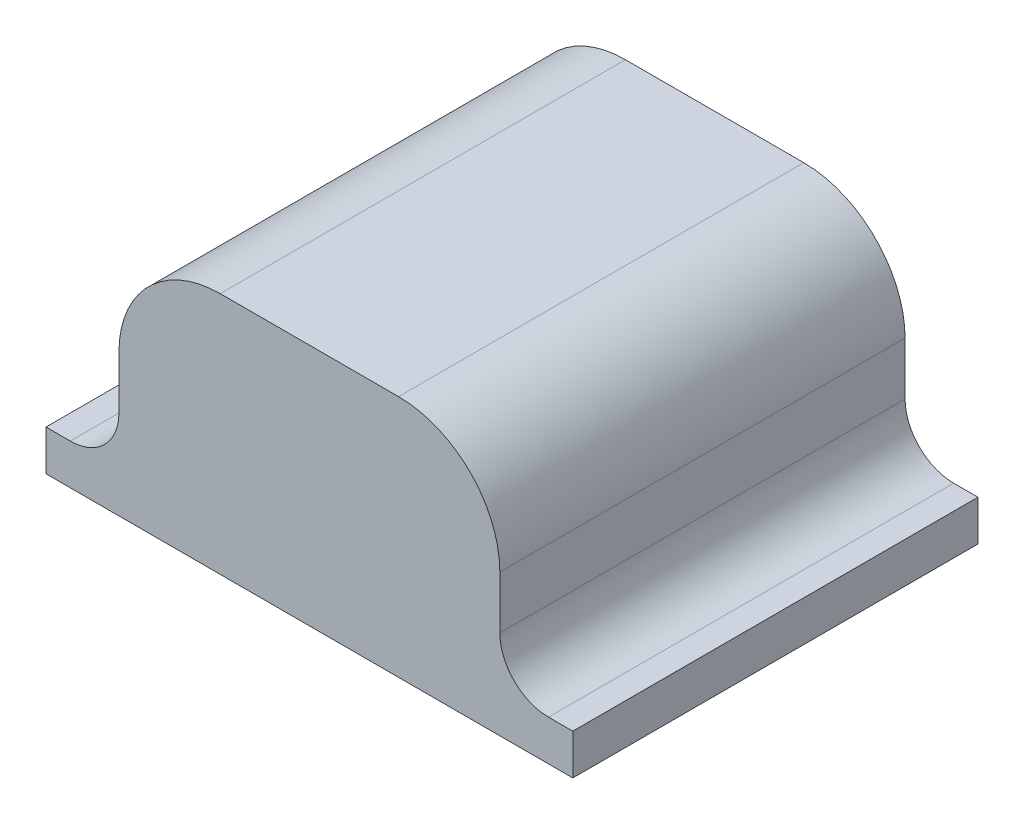
ISO-10303-21;
HEADER;
FILE_DESCRIPTION(('STEP AP214'),'2;1');
FILE_NAME('part.step','',(''),(''),'','','');
FILE_SCHEMA(('AUTOMOTIVE_DESIGN { 1 0 10303 214 1 1 1 1 }'));
ENDSEC;
DATA;
#1=APPLICATION_CONTEXT('core data for automotive mechanical design processes');
#2=APPLICATION_PROTOCOL_DEFINITION('international standard','automotive_design',2000,#1);
#3=PRODUCT_CONTEXT('',#1,'mechanical');
#4=PRODUCT('Part','Part','',(#3));
#5=PRODUCT_RELATED_PRODUCT_CATEGORY('part','',(#4));
#6=PRODUCT_DEFINITION_FORMATION('','',#4);
#7=PRODUCT_DEFINITION_CONTEXT('part definition',#1,'design');
#8=PRODUCT_DEFINITION('design','',#6,#7);
#9=PRODUCT_DEFINITION_SHAPE('','',#8);
#10=(LENGTH_UNIT() NAMED_UNIT(*) SI_UNIT(.MILLI.,.METRE.));
#11=(NAMED_UNIT(*) PLANE_ANGLE_UNIT() SI_UNIT($,.RADIAN.));
#12=(NAMED_UNIT(*) SI_UNIT($,.STERADIAN.) SOLID_ANGLE_UNIT());
#13=UNCERTAINTY_MEASURE_WITH_UNIT(LENGTH_MEASURE(1.E-05),#10,'distance_accuracy_value','');
#14=(GEOMETRIC_REPRESENTATION_CONTEXT(3) GLOBAL_UNCERTAINTY_ASSIGNED_CONTEXT((#13)) GLOBAL_UNIT_ASSIGNED_CONTEXT((#10,
#11,#12)) REPRESENTATION_CONTEXT('',''));
#15=CARTESIAN_POINT('',(0.,0.,0.));
#16=DIRECTION('',(0.,0.,1.));
#17=DIRECTION('',(1.,0.,0.));
#18=AXIS2_PLACEMENT_3D('',#15,#16,#17);
#19=CARTESIAN_POINT('',(21.5,17.5,10.));
#20=DIRECTION('',(0.,0.,-1.));
#21=DIRECTION('',(-1.,0.,0.));
#22=AXIS2_PLACEMENT_3D('',#19,#20,#21);
#23=CYLINDRICAL_SURFACE('',#22,6.);
#24=CARTESIAN_POINT('',(21.5,17.5,3.2));
#25=DIRECTION('',(0.,0.,-1.));
#26=DIRECTION('',(-1.,0.,0.));
#27=AXIS2_PLACEMENT_3D('',#24,#25,#26);
#28=CIRCLE('',#27,6.);
#29=CARTESIAN_POINT('',(15.5,17.5,3.2));
#30=VERTEX_POINT('',#29);
#31=EDGE_CURVE('E230',#30,#30,#28,.F.);
#32=ORIENTED_EDGE('',*,*,#31,.T.);
#33=EDGE_LOOP('',(#32));
#34=FACE_BOUND('',#33,.T.);
#35=CARTESIAN_POINT('',(21.5,17.5,0.750000000000001));
#36=DIRECTION('',(0.,0.,-1.));
#37=DIRECTION('',(-1.,0.,0.));
#38=AXIS2_PLACEMENT_3D('',#35,#36,#37);
#39=CIRCLE('',#38,6.);
#40=CARTESIAN_POINT('',(15.5,17.5,0.750000000000001));
#41=VERTEX_POINT('',#40);
#42=EDGE_CURVE('E47',#41,#41,#39,.T.);
#43=ORIENTED_EDGE('',*,*,#42,.T.);
#44=EDGE_LOOP('',(#43));
#45=FACE_BOUND('',#44,.T.);
#46=ADVANCED_FACE('F43',(#34,#45),#23,.F.);
#47=CARTESIAN_POINT('',(43.5,17.5,10.));
#48=DIRECTION('',(0.,0.,-1.));
#49=DIRECTION('',(-1.,0.,0.));
#50=AXIS2_PLACEMENT_3D('',#47,#48,#49);
#51=CYLINDRICAL_SURFACE('',#50,3.5);
#52=CARTESIAN_POINT('',(43.5,17.5,6.));
#53=DIRECTION('',(0.,0.,-1.));
#54=DIRECTION('',(-1.,0.,0.));
#55=AXIS2_PLACEMENT_3D('',#52,#53,#54);
#56=CIRCLE('',#55,3.5);
#57=CARTESIAN_POINT('',(40.,17.5,6.));
#58=VERTEX_POINT('',#57);
#59=EDGE_CURVE('E239',#58,#58,#56,.T.);
#60=ORIENTED_EDGE('',*,*,#59,.F.);
#61=EDGE_LOOP('',(#60));
#62=FACE_BOUND('',#61,.T.);
#63=CARTESIAN_POINT('',(43.5,17.5,3.));
#64=DIRECTION('',(0.,0.,-1.));
#65=DIRECTION('',(-1.,0.,0.));
#66=AXIS2_PLACEMENT_3D('',#63,#64,#65);
#67=CIRCLE('',#66,3.5);
#68=CARTESIAN_POINT('',(40.,17.5,3.));
#69=VERTEX_POINT('',#68);
#70=EDGE_CURVE('E237',#69,#69,#67,.T.);
#71=ORIENTED_EDGE('',*,*,#70,.T.);
#72=EDGE_LOOP('',(#71));
#73=FACE_BOUND('',#72,.T.);
#74=ADVANCED_FACE('F363',(#62,#73),#51,.F.);
#75=CARTESIAN_POINT('',(21.5,17.5,50.));
#76=DIRECTION('',(0.,0.,-1.));
#77=DIRECTION('',(-1.,0.,0.));
#78=AXIS2_PLACEMENT_3D('',#75,#76,#77);
#79=CYLINDRICAL_SURFACE('',#78,12.5);
#80=CARTESIAN_POINT('',(21.5,17.5,0.));
#81=DIRECTION('',(0.,0.,-1.));
#82=DIRECTION('',(-1.,0.,0.));
#83=AXIS2_PLACEMENT_3D('',#80,#81,#82);
#84=CIRCLE('',#83,12.5);
#85=CARTESIAN_POINT('',(9.,17.5,0.));
#86=VERTEX_POINT('',#85);
#87=CARTESIAN_POINT('',(21.5,30.,0.));
#88=VERTEX_POINT('',#87);
#89=EDGE_CURVE('E179',#86,#88,#84,.T.);
#90=ORIENTED_EDGE('',*,*,#89,.F.);
#91=DIRECTION('',(0.,0.,-1.));
#92=VECTOR('',#91,1.);
#93=CARTESIAN_POINT('',(9.,17.5,50.));
#94=LINE('',#93,#92);
#95=CARTESIAN_POINT('',(9.,17.5,50.));
#96=VERTEX_POINT('',#95);
#97=EDGE_CURVE('E13',#96,#86,#94,.T.);
#98=ORIENTED_EDGE('',*,*,#97,.F.);
#99=CARTESIAN_POINT('',(21.5,17.5,50.));
#100=DIRECTION('',(0.,0.,-1.));
#101=DIRECTION('',(-1.,0.,0.));
#102=AXIS2_PLACEMENT_3D('',#99,#100,#101);
#103=CIRCLE('',#102,12.5);
#104=CARTESIAN_POINT('',(21.5,30.,50.));
#105=VERTEX_POINT('',#104);
#106=EDGE_CURVE('E211',#96,#105,#103,.T.);
#107=ORIENTED_EDGE('',*,*,#106,.T.);
#108=DIRECTION('',(0.,0.,-1.));
#109=VECTOR('',#108,1.);
#110=CARTESIAN_POINT('',(21.5,30.,50.));
#111=LINE('',#110,#109);
#112=EDGE_CURVE('E118',#105,#88,#111,.T.);
#113=ORIENTED_EDGE('',*,*,#112,.T.);
#114=EDGE_LOOP('',(#90,#98,#107,#113));
#115=FACE_BOUND('',#114,.T.);
#116=ADVANCED_FACE('F45',(#115),#79,.T.);
#117=CARTESIAN_POINT('',(9.,11.,50.));
#118=DIRECTION('',(-1.,0.,0.));
#119=DIRECTION('',(0.,0.,1.));
#120=AXIS2_PLACEMENT_3D('',#117,#118,#119);
#121=PLANE('',#120);
#122=DIRECTION('',(0.,1.,0.));
#123=VECTOR('',#122,1.);
#124=CARTESIAN_POINT('',(9.,11.,0.));
#125=LINE('',#124,#123);
#126=CARTESIAN_POINT('',(9.,11.,0.));
#127=VERTEX_POINT('',#126);
#128=EDGE_CURVE('E209',#127,#86,#125,.T.);
#129=ORIENTED_EDGE('',*,*,#128,.F.);
#130=DIRECTION('',(0.,0.,-1.));
#131=VECTOR('',#130,1.);
#132=CARTESIAN_POINT('',(9.,11.,50.));
#133=LINE('',#132,#131);
#134=CARTESIAN_POINT('',(9.,11.,50.));
#135=VERTEX_POINT('',#134);
#136=EDGE_CURVE('E52',#135,#127,#133,.T.);
#137=ORIENTED_EDGE('',*,*,#136,.F.);
#138=DIRECTION('',(0.,1.,0.));
#139=VECTOR('',#138,1.);
#140=CARTESIAN_POINT('',(9.,11.,50.));
#141=LINE('',#140,#139);
#142=EDGE_CURVE('E169',#135,#96,#141,.T.);
#143=ORIENTED_EDGE('',*,*,#142,.T.);
#144=ORIENTED_EDGE('',*,*,#97,.T.);
#145=EDGE_LOOP('',(#129,#137,#143,#144));
#146=FACE_BOUND('',#145,.T.);
#147=ADVANCED_FACE('F355',(#146),#121,.T.);
#148=CARTESIAN_POINT('',(3.,11.,50.));
#149=DIRECTION('',(0.,0.,-1.));
#150=DIRECTION('',(-1.,0.,0.));
#151=AXIS2_PLACEMENT_3D('',#148,#149,#150);
#152=CYLINDRICAL_SURFACE('',#151,6.);
#153=CARTESIAN_POINT('',(3.,11.,0.));
#154=DIRECTION('',(0.,0.,1.));
#155=DIRECTION('',(1.,0.,0.));
#156=AXIS2_PLACEMENT_3D('',#153,#154,#155);
#157=CIRCLE('',#156,6.);
#158=CARTESIAN_POINT('',(3.,5.,0.));
#159=VERTEX_POINT('',#158);
#160=EDGE_CURVE('E156',#159,#127,#157,.T.);
#161=ORIENTED_EDGE('',*,*,#160,.F.);
#162=DIRECTION('',(0.,0.,-1.));
#163=VECTOR('',#162,1.);
#164=CARTESIAN_POINT('',(3.,5.,50.));
#165=LINE('',#164,#163);
#166=CARTESIAN_POINT('',(3.,5.,50.));
#167=VERTEX_POINT('',#166);
#168=EDGE_CURVE('E150',#167,#159,#165,.T.);
#169=ORIENTED_EDGE('',*,*,#168,.F.);
#170=CARTESIAN_POINT('',(3.,11.,50.));
#171=DIRECTION('',(0.,0.,1.));
#172=DIRECTION('',(1.,0.,0.));
#173=AXIS2_PLACEMENT_3D('',#170,#171,#172);
#174=CIRCLE('',#173,6.);
#175=EDGE_CURVE('E153',#167,#135,#174,.T.);
#176=ORIENTED_EDGE('',*,*,#175,.T.);
#177=ORIENTED_EDGE('',*,*,#136,.T.);
#178=EDGE_LOOP('',(#161,#169,#176,#177));
#179=FACE_BOUND('',#178,.T.);
#180=ADVANCED_FACE('F152',(#179),#152,.F.);
#181=CARTESIAN_POINT('',(0.,5.,50.));
#182=DIRECTION('',(0.,1.,0.));
#183=DIRECTION('',(-1.,0.,0.));
#184=AXIS2_PLACEMENT_3D('',#181,#182,#183);
#185=PLANE('',#184);
#186=DIRECTION('',(1.,0.,0.));
#187=VECTOR('',#186,1.);
#188=CARTESIAN_POINT('',(0.,5.,0.));
#189=LINE('',#188,#187);
#190=CARTESIAN_POINT('',(0.,5.,0.));
#191=VERTEX_POINT('',#190);
#192=EDGE_CURVE('E206',#191,#159,#189,.T.);
#193=ORIENTED_EDGE('',*,*,#192,.F.);
#194=DIRECTION('',(0.,0.,-1.));
#195=VECTOR('',#194,1.);
#196=CARTESIAN_POINT('',(0.,5.,50.));
#197=LINE('',#196,#195);
#198=CARTESIAN_POINT('',(0.,5.,50.));
#199=VERTEX_POINT('',#198);
#200=EDGE_CURVE('E161',#199,#191,#197,.T.);
#201=ORIENTED_EDGE('',*,*,#200,.F.);
#202=DIRECTION('',(1.,0.,0.));
#203=VECTOR('',#202,1.);
#204=CARTESIAN_POINT('',(0.,5.,50.));
#205=LINE('',#204,#203);
#206=EDGE_CURVE('E167',#199,#167,#205,.T.);
#207=ORIENTED_EDGE('',*,*,#206,.T.);
#208=ORIENTED_EDGE('',*,*,#168,.T.);
#209=EDGE_LOOP('',(#193,#201,#207,#208));
#210=FACE_BOUND('',#209,.T.);
#211=ADVANCED_FACE('F171',(#210),#185,.T.);
#212=CARTESIAN_POINT('',(0.,0.,50.));
#213=DIRECTION('',(-1.,0.,0.));
#214=DIRECTION('',(0.,0.,1.));
#215=AXIS2_PLACEMENT_3D('',#212,#213,#214);
#216=PLANE('',#215);
#217=DIRECTION('',(0.,1.,0.));
#218=VECTOR('',#217,1.);
#219=CARTESIAN_POINT('',(0.,0.,0.));
#220=LINE('',#219,#218);
#221=CARTESIAN_POINT('',(0.,0.,0.));
#222=VERTEX_POINT('',#221);
#223=EDGE_CURVE('E203',#222,#191,#220,.T.);
#224=ORIENTED_EDGE('',*,*,#223,.F.);
#225=DIRECTION('',(0.,0.,-1.));
#226=VECTOR('',#225,1.);
#227=CARTESIAN_POINT('',(0.,0.,50.));
#228=LINE('',#227,#226);
#229=CARTESIAN_POINT('',(0.,0.,50.));
#230=VERTEX_POINT('',#229);
#231=EDGE_CURVE('E215',#230,#222,#228,.T.);
#232=ORIENTED_EDGE('',*,*,#231,.F.);
#233=DIRECTION('',(0.,1.,0.));
#234=VECTOR('',#233,1.);
#235=CARTESIAN_POINT('',(0.,0.,50.));
#236=LINE('',#235,#234);
#237=EDGE_CURVE('E172',#230,#199,#236,.T.);
#238=ORIENTED_EDGE('',*,*,#237,.T.);
#239=ORIENTED_EDGE('',*,*,#200,.T.);
#240=EDGE_LOOP('',(#224,#232,#238,#239));
#241=FACE_BOUND('',#240,.T.);
#242=ADVANCED_FACE('F552',(#241),#216,.T.);
#243=CARTESIAN_POINT('',(65.,0.,50.));
#244=DIRECTION('',(0.,-1.,0.));
#245=DIRECTION('',(1.,0.,0.));
#246=AXIS2_PLACEMENT_3D('',#243,#244,#245);
#247=PLANE('',#246);
#248=DIRECTION('',(-1.,0.,0.));
#249=VECTOR('',#248,1.);
#250=CARTESIAN_POINT('',(11.4,0.,3.2));
#251=LINE('',#250,#249);
#252=CARTESIAN_POINT('',(53.6,0.,3.2));
#253=VERTEX_POINT('',#252);
#254=CARTESIAN_POINT('',(11.4,0.,3.2));
#255=VERTEX_POINT('',#254);
#256=EDGE_CURVE('E279',#253,#255,#251,.T.);
#257=ORIENTED_EDGE('',*,*,#256,.T.);
#258=DIRECTION('',(0.,0.,-1.));
#259=VECTOR('',#258,1.);
#260=CARTESIAN_POINT('',(11.4,0.,100.424200539027));
#261=LINE('',#260,#259);
#262=CARTESIAN_POINT('',(11.4,0.,46.8));
#263=VERTEX_POINT('',#262);
#264=EDGE_CURVE('E300',#263,#255,#261,.T.);
#265=ORIENTED_EDGE('',*,*,#264,.F.);
#266=DIRECTION('',(1.,0.,0.));
#267=VECTOR('',#266,1.);
#268=CARTESIAN_POINT('',(11.4,0.,46.8));
#269=LINE('',#268,#267);
#270=CARTESIAN_POINT('',(53.6,0.,46.8));
#271=VERTEX_POINT('',#270);
#272=EDGE_CURVE('E258',#263,#271,#269,.T.);
#273=ORIENTED_EDGE('',*,*,#272,.T.);
#274=DIRECTION('',(0.,0.,-1.));
#275=VECTOR('',#274,1.);
#276=CARTESIAN_POINT('',(53.6,0.,100.424200539027));
#277=LINE('',#276,#275);
#278=EDGE_CURVE('E303',#271,#253,#277,.T.);
#279=ORIENTED_EDGE('',*,*,#278,.T.);
#280=EDGE_LOOP('',(#257,#265,#273,#279));
#281=FACE_BOUND('',#280,.T.);
#282=DIRECTION('',(-1.,0.,0.));
#283=VECTOR('',#282,1.);
#284=CARTESIAN_POINT('',(65.,0.,0.));
#285=LINE('',#284,#283);
#286=CARTESIAN_POINT('',(65.,0.,0.));
#287=VERTEX_POINT('',#286);
#288=EDGE_CURVE('E200',#287,#222,#285,.T.);
#289=ORIENTED_EDGE('',*,*,#288,.F.);
#290=DIRECTION('',(0.,0.,-1.));
#291=VECTOR('',#290,1.);
#292=CARTESIAN_POINT('',(65.,0.,50.));
#293=LINE('',#292,#291);
#294=CARTESIAN_POINT('',(65.,0.,50.));
#295=VERTEX_POINT('',#294);
#296=EDGE_CURVE('E217',#295,#287,#293,.T.);
#297=ORIENTED_EDGE('',*,*,#296,.F.);
#298=DIRECTION('',(-1.,0.,0.));
#299=VECTOR('',#298,1.);
#300=CARTESIAN_POINT('',(65.,0.,50.));
#301=LINE('',#300,#299);
#302=EDGE_CURVE('E174',#295,#230,#301,.T.);
#303=ORIENTED_EDGE('',*,*,#302,.T.);
#304=ORIENTED_EDGE('',*,*,#231,.T.);
#305=EDGE_LOOP('',(#289,#297,#303,#304));
#306=FACE_BOUND('',#305,.T.);
#307=ADVANCED_FACE('F330',(#281,#306),#247,.T.);
#308=CARTESIAN_POINT('',(65.,5.,50.));
#309=DIRECTION('',(1.,0.,0.));
#310=DIRECTION('',(0.,0.,-1.));
#311=AXIS2_PLACEMENT_3D('',#308,#309,#310);
#312=PLANE('',#311);
#313=DIRECTION('',(0.,-1.,0.));
#314=VECTOR('',#313,1.);
#315=CARTESIAN_POINT('',(65.,5.,0.));
#316=LINE('',#315,#314);
#317=CARTESIAN_POINT('',(65.,5.,0.));
#318=VERTEX_POINT('',#317);
#319=EDGE_CURVE('E197',#318,#287,#316,.T.);
#320=ORIENTED_EDGE('',*,*,#319,.F.);
#321=DIRECTION('',(0.,0.,-1.));
#322=VECTOR('',#321,1.);
#323=CARTESIAN_POINT('',(65.,5.,50.));
#324=LINE('',#323,#322);
#325=CARTESIAN_POINT('',(65.,5.,50.));
#326=VERTEX_POINT('',#325);
#327=EDGE_CURVE('E219',#326,#318,#324,.T.);
#328=ORIENTED_EDGE('',*,*,#327,.F.);
#329=DIRECTION('',(0.,-1.,0.));
#330=VECTOR('',#329,1.);
#331=CARTESIAN_POINT('',(65.,5.,50.));
#332=LINE('',#331,#330);
#333=EDGE_CURVE('E324',#326,#295,#332,.T.);
#334=ORIENTED_EDGE('',*,*,#333,.T.);
#335=ORIENTED_EDGE('',*,*,#296,.T.);
#336=EDGE_LOOP('',(#320,#328,#334,#335));
#337=FACE_BOUND('',#336,.T.);
#338=ADVANCED_FACE('F336',(#337),#312,.T.);
#339=CARTESIAN_POINT('',(62.,5.,50.));
#340=DIRECTION('',(0.,1.,0.));
#341=DIRECTION('',(0.,0.,1.));
#342=AXIS2_PLACEMENT_3D('',#339,#340,#341);
#343=PLANE('',#342);
#344=DIRECTION('',(1.,0.,0.));
#345=VECTOR('',#344,1.);
#346=CARTESIAN_POINT('',(62.,5.,0.));
#347=LINE('',#346,#345);
#348=CARTESIAN_POINT('',(62.,5.00000000000001,0.));
#349=VERTEX_POINT('',#348);
#350=EDGE_CURVE('E194',#349,#318,#347,.T.);
#351=ORIENTED_EDGE('',*,*,#350,.F.);
#352=DIRECTION('',(0.,0.,-1.));
#353=VECTOR('',#352,1.);
#354=CARTESIAN_POINT('',(62.,5.00000000000001,50.));
#355=LINE('',#354,#353);
#356=CARTESIAN_POINT('',(62.,5.00000000000001,50.));
#357=VERTEX_POINT('',#356);
#358=EDGE_CURVE('E221',#357,#349,#355,.T.);
#359=ORIENTED_EDGE('',*,*,#358,.F.);
#360=DIRECTION('',(1.,0.,0.));
#361=VECTOR('',#360,1.);
#362=CARTESIAN_POINT('',(62.,5.,50.));
#363=LINE('',#362,#361);
#364=EDGE_CURVE('E321',#357,#326,#363,.T.);
#365=ORIENTED_EDGE('',*,*,#364,.T.);
#366=ORIENTED_EDGE('',*,*,#327,.T.);
#367=EDGE_LOOP('',(#351,#359,#365,#366));
#368=FACE_BOUND('',#367,.T.);
#369=ADVANCED_FACE('F339',(#368),#343,.T.);
#370=CARTESIAN_POINT('',(62.,11.,50.));
#371=DIRECTION('',(0.,0.,-1.));
#372=DIRECTION('',(-1.,0.,0.));
#373=AXIS2_PLACEMENT_3D('',#370,#371,#372);
#374=CYLINDRICAL_SURFACE('',#373,6.);
#375=CARTESIAN_POINT('',(62.,11.,0.));
#376=DIRECTION('',(0.,0.,1.));
#377=DIRECTION('',(1.,0.,0.));
#378=AXIS2_PLACEMENT_3D('',#375,#376,#377);
#379=CIRCLE('',#378,6.);
#380=CARTESIAN_POINT('',(56.,11.,0.));
#381=VERTEX_POINT('',#380);
#382=EDGE_CURVE('E191',#381,#349,#379,.T.);
#383=ORIENTED_EDGE('',*,*,#382,.F.);
#384=DIRECTION('',(0.,0.,-1.));
#385=VECTOR('',#384,1.);
#386=CARTESIAN_POINT('',(56.,11.,50.));
#387=LINE('',#386,#385);
#388=CARTESIAN_POINT('',(56.,11.,50.));
#389=VERTEX_POINT('',#388);
#390=EDGE_CURVE('E223',#389,#381,#387,.T.);
#391=ORIENTED_EDGE('',*,*,#390,.F.);
#392=CARTESIAN_POINT('',(62.,11.,50.));
#393=DIRECTION('',(0.,0.,1.));
#394=DIRECTION('',(1.,0.,0.));
#395=AXIS2_PLACEMENT_3D('',#392,#393,#394);
#396=CIRCLE('',#395,6.);
#397=EDGE_CURVE('E318',#389,#357,#396,.T.);
#398=ORIENTED_EDGE('',*,*,#397,.T.);
#399=ORIENTED_EDGE('',*,*,#358,.T.);
#400=EDGE_LOOP('',(#383,#391,#398,#399));
#401=FACE_BOUND('',#400,.T.);
#402=ADVANCED_FACE('F344',(#401),#374,.F.);
#403=CARTESIAN_POINT('',(56.,17.5,50.));
#404=DIRECTION('',(1.,0.,0.));
#405=DIRECTION('',(0.,1.,0.));
#406=AXIS2_PLACEMENT_3D('',#403,#404,#405);
#407=PLANE('',#406);
#408=DIRECTION('',(0.,-1.,0.));
#409=VECTOR('',#408,1.);
#410=CARTESIAN_POINT('',(56.,17.5,0.));
#411=LINE('',#410,#409);
#412=CARTESIAN_POINT('',(56.,17.5,0.));
#413=VERTEX_POINT('',#412);
#414=EDGE_CURVE('E188',#413,#381,#411,.T.);
#415=ORIENTED_EDGE('',*,*,#414,.F.);
#416=DIRECTION('',(0.,0.,-1.));
#417=VECTOR('',#416,1.);
#418=CARTESIAN_POINT('',(56.,17.5,50.));
#419=LINE('',#418,#417);
#420=CARTESIAN_POINT('',(56.,17.5,50.));
#421=VERTEX_POINT('',#420);
#422=EDGE_CURVE('E225',#421,#413,#419,.T.);
#423=ORIENTED_EDGE('',*,*,#422,.F.);
#424=DIRECTION('',(0.,-1.,0.));
#425=VECTOR('',#424,1.);
#426=CARTESIAN_POINT('',(56.,17.5,50.));
#427=LINE('',#426,#425);
#428=EDGE_CURVE('E315',#421,#389,#427,.T.);
#429=ORIENTED_EDGE('',*,*,#428,.T.);
#430=ORIENTED_EDGE('',*,*,#390,.T.);
#431=EDGE_LOOP('',(#415,#423,#429,#430));
#432=FACE_BOUND('',#431,.T.);
#433=ADVANCED_FACE('F347',(#432),#407,.T.);
#434=CARTESIAN_POINT('',(43.5,17.5,50.));
#435=DIRECTION('',(0.,0.,-1.));
#436=DIRECTION('',(-1.,0.,0.));
#437=AXIS2_PLACEMENT_3D('',#434,#435,#436);
#438=CYLINDRICAL_SURFACE('',#437,12.5);
#439=CARTESIAN_POINT('',(43.5,17.5,0.));
#440=DIRECTION('',(0.,0.,-1.));
#441=DIRECTION('',(-1.,0.,0.));
#442=AXIS2_PLACEMENT_3D('',#439,#440,#441);
#443=CIRCLE('',#442,12.5);
#444=CARTESIAN_POINT('',(43.5,30.,0.));
#445=VERTEX_POINT('',#444);
#446=EDGE_CURVE('E185',#445,#413,#443,.T.);
#447=ORIENTED_EDGE('',*,*,#446,.F.);
#448=DIRECTION('',(0.,0.,-1.));
#449=VECTOR('',#448,1.);
#450=CARTESIAN_POINT('',(43.5,30.,50.));
#451=LINE('',#450,#449);
#452=CARTESIAN_POINT('',(43.5,30.,50.));
#453=VERTEX_POINT('',#452);
#454=EDGE_CURVE('E227',#453,#445,#451,.T.);
#455=ORIENTED_EDGE('',*,*,#454,.F.);
#456=CARTESIAN_POINT('',(43.5,17.5,50.));
#457=DIRECTION('',(0.,0.,-1.));
#458=DIRECTION('',(-1.,0.,0.));
#459=AXIS2_PLACEMENT_3D('',#456,#457,#458);
#460=CIRCLE('',#459,12.5);
#461=EDGE_CURVE('E312',#453,#421,#460,.T.);
#462=ORIENTED_EDGE('',*,*,#461,.T.);
#463=ORIENTED_EDGE('',*,*,#422,.T.);
#464=EDGE_LOOP('',(#447,#455,#462,#463));
#465=FACE_BOUND('',#464,.T.);
#466=ADVANCED_FACE('F351',(#465),#438,.T.);
#467=CARTESIAN_POINT('',(21.5,30.,50.));
#468=DIRECTION('',(0.,1.,0.));
#469=DIRECTION('',(0.,0.,1.));
#470=AXIS2_PLACEMENT_3D('',#467,#468,#469);
#471=PLANE('',#470);
#472=DIRECTION('',(1.,0.,0.));
#473=VECTOR('',#472,1.);
#474=CARTESIAN_POINT('',(21.5,30.,0.));
#475=LINE('',#474,#473);
#476=EDGE_CURVE('E182',#88,#445,#475,.T.);
#477=ORIENTED_EDGE('',*,*,#476,.F.);
#478=ORIENTED_EDGE('',*,*,#112,.F.);
#479=DIRECTION('',(1.,0.,0.));
#480=VECTOR('',#479,1.);
#481=CARTESIAN_POINT('',(21.5,30.,50.));
#482=LINE('',#481,#480);
#483=EDGE_CURVE('E310',#105,#453,#482,.T.);
#484=ORIENTED_EDGE('',*,*,#483,.T.);
#485=ORIENTED_EDGE('',*,*,#454,.T.);
#486=EDGE_LOOP('',(#477,#478,#484,#485));
#487=FACE_BOUND('',#486,.T.);
#488=ADVANCED_FACE('F352',(#487),#471,.T.);
#489=CARTESIAN_POINT('',(21.5,17.5,50.));
#490=DIRECTION('',(0.,0.,-1.));
#491=DIRECTION('',(-1.,0.,0.));
#492=AXIS2_PLACEMENT_3D('',#489,#490,#491);
#493=PLANE('',#492);
#494=ORIENTED_EDGE('',*,*,#106,.F.);
#495=ORIENTED_EDGE('',*,*,#142,.F.);
#496=ORIENTED_EDGE('',*,*,#175,.F.);
#497=ORIENTED_EDGE('',*,*,#206,.F.);
#498=ORIENTED_EDGE('',*,*,#237,.F.);
#499=ORIENTED_EDGE('',*,*,#302,.F.);
#500=ORIENTED_EDGE('',*,*,#333,.F.);
#501=ORIENTED_EDGE('',*,*,#364,.F.);
#502=ORIENTED_EDGE('',*,*,#397,.F.);
#503=ORIENTED_EDGE('',*,*,#428,.F.);
#504=ORIENTED_EDGE('',*,*,#461,.F.);
#505=ORIENTED_EDGE('',*,*,#483,.F.);
#506=EDGE_LOOP('',(#494,#495,#496,#497,#498,#499,#500,#501,#502,#503,#504,#505));
#507=FACE_BOUND('',#506,.T.);
#508=ADVANCED_FACE('F165',(#507),#493,.F.);
#509=CARTESIAN_POINT('',(21.5,17.5,0.));
#510=DIRECTION('',(0.,0.,-1.));
#511=DIRECTION('',(-1.,0.,0.));
#512=AXIS2_PLACEMENT_3D('',#509,#510,#511);
#513=PLANE('',#512);
#514=CARTESIAN_POINT('',(21.5,17.5,0.));
#515=DIRECTION('',(0.,0.,-1.));
#516=DIRECTION('',(-1.,0.,0.));
#517=AXIS2_PLACEMENT_3D('',#514,#515,#516);
#518=CIRCLE('',#517,7.);
#519=CARTESIAN_POINT('',(14.5,17.5,0.));
#520=VERTEX_POINT('',#519);
#521=EDGE_CURVE('E253',#520,#520,#518,.T.);
#522=ORIENTED_EDGE('',*,*,#521,.F.);
#523=EDGE_LOOP('',(#522));
#524=FACE_BOUND('',#523,.T.);
#525=CARTESIAN_POINT('',(43.5,17.5,0.));
#526=DIRECTION('',(0.,0.,-1.));
#527=DIRECTION('',(-1.,0.,0.));
#528=AXIS2_PLACEMENT_3D('',#525,#526,#527);
#529=CIRCLE('',#528,6.5);
#530=CARTESIAN_POINT('',(37.,17.5,0.));
#531=VERTEX_POINT('',#530);
#532=EDGE_CURVE('E246',#531,#531,#529,.T.);
#533=ORIENTED_EDGE('',*,*,#532,.F.);
#534=EDGE_LOOP('',(#533));
#535=FACE_BOUND('',#534,.T.);
#536=ORIENTED_EDGE('',*,*,#89,.T.);
#537=ORIENTED_EDGE('',*,*,#476,.T.);
#538=ORIENTED_EDGE('',*,*,#446,.T.);
#539=ORIENTED_EDGE('',*,*,#414,.T.);
#540=ORIENTED_EDGE('',*,*,#382,.T.);
#541=ORIENTED_EDGE('',*,*,#350,.T.);
#542=ORIENTED_EDGE('',*,*,#319,.T.);
#543=ORIENTED_EDGE('',*,*,#288,.T.);
#544=ORIENTED_EDGE('',*,*,#223,.T.);
#545=ORIENTED_EDGE('',*,*,#192,.T.);
#546=ORIENTED_EDGE('',*,*,#160,.T.);
#547=ORIENTED_EDGE('',*,*,#128,.T.);
#548=EDGE_LOOP('',(#536,#537,#538,#539,#540,#541,#542,#543,#544,#545,#546,#547));
#549=FACE_BOUND('',#548,.T.);
#550=ADVANCED_FACE('F354',(#524,#535,#549),#513,.T.);
#551=CARTESIAN_POINT('',(43.5,17.5,100.424200539027));
#552=DIRECTION('',(0.,0.,-1.));
#553=DIRECTION('',(-1.,0.,0.));
#554=AXIS2_PLACEMENT_3D('',#551,#552,#553);
#555=CYLINDRICAL_SURFACE('',#554,10.1);
#556=CARTESIAN_POINT('',(43.5,17.5,46.8));
#557=DIRECTION('',(0.,0.,-1.));
#558=DIRECTION('',(-1.,0.,0.));
#559=AXIS2_PLACEMENT_3D('',#556,#557,#558);
#560=CIRCLE('',#559,10.1);
#561=CARTESIAN_POINT('',(53.6,17.5,46.8));
#562=VERTEX_POINT('',#561);
#563=CARTESIAN_POINT('',(43.5,27.6,46.8));
#564=VERTEX_POINT('',#563);
#565=EDGE_CURVE('E271',#562,#564,#560,.F.);
#566=ORIENTED_EDGE('',*,*,#565,.T.);
#567=DIRECTION('',(0.,0.,-1.));
#568=VECTOR('',#567,1.);
#569=CARTESIAN_POINT('',(43.5,27.6,100.424200539027));
#570=LINE('',#569,#568);
#571=CARTESIAN_POINT('',(43.5,27.6,3.2));
#572=VERTEX_POINT('',#571);
#573=EDGE_CURVE('E262',#564,#572,#570,.T.);
#574=ORIENTED_EDGE('',*,*,#573,.T.);
#575=CARTESIAN_POINT('',(43.5,17.5,3.2));
#576=DIRECTION('',(0.,0.,-1.));
#577=DIRECTION('',(-1.,0.,0.));
#578=AXIS2_PLACEMENT_3D('',#575,#576,#577);
#579=CIRCLE('',#578,10.1);
#580=CARTESIAN_POINT('',(53.6,17.5,3.2));
#581=VERTEX_POINT('',#580);
#582=EDGE_CURVE('E233',#572,#581,#579,.T.);
#583=ORIENTED_EDGE('',*,*,#582,.T.);
#584=DIRECTION('',(0.,0.,-1.));
#585=VECTOR('',#584,1.);
#586=CARTESIAN_POINT('',(53.6,17.5,100.424200539027));
#587=LINE('',#586,#585);
#588=EDGE_CURVE('E291',#562,#581,#587,.T.);
#589=ORIENTED_EDGE('',*,*,#588,.F.);
#590=EDGE_LOOP('',(#566,#574,#583,#589));
#591=FACE_BOUND('',#590,.T.);
#592=ADVANCED_FACE('F390',(#591),#555,.F.);
#593=CARTESIAN_POINT('',(21.5,27.6,100.424200539027));
#594=DIRECTION('',(0.,1.,0.));
#595=DIRECTION('',(-1.,0.,0.));
#596=AXIS2_PLACEMENT_3D('',#593,#594,#595);
#597=PLANE('',#596);
#598=DIRECTION('',(-1.,0.,0.));
#599=VECTOR('',#598,1.);
#600=CARTESIAN_POINT('',(21.5,27.6,46.8));
#601=LINE('',#600,#599);
#602=CARTESIAN_POINT('',(21.5,27.6,46.8));
#603=VERTEX_POINT('',#602);
#604=EDGE_CURVE('E268',#564,#603,#601,.T.);
#605=ORIENTED_EDGE('',*,*,#604,.T.);
#606=DIRECTION('',(0.,0.,-1.));
#607=VECTOR('',#606,1.);
#608=CARTESIAN_POINT('',(21.5,27.6,100.424200539027));
#609=LINE('',#608,#607);
#610=CARTESIAN_POINT('',(21.5,27.6,3.2));
#611=VERTEX_POINT('',#610);
#612=EDGE_CURVE('E294',#603,#611,#609,.T.);
#613=ORIENTED_EDGE('',*,*,#612,.T.);
#614=DIRECTION('',(1.,0.,0.));
#615=VECTOR('',#614,1.);
#616=CARTESIAN_POINT('',(21.5,27.6,3.2));
#617=LINE('',#616,#615);
#618=EDGE_CURVE('E288',#611,#572,#617,.T.);
#619=ORIENTED_EDGE('',*,*,#618,.T.);
#620=ORIENTED_EDGE('',*,*,#573,.F.);
#621=EDGE_LOOP('',(#605,#613,#619,#620));
#622=FACE_BOUND('',#621,.T.);
#623=ADVANCED_FACE('F386',(#622),#597,.F.);
#624=CARTESIAN_POINT('',(21.5,17.5,100.424200539027));
#625=DIRECTION('',(0.,0.,-1.));
#626=DIRECTION('',(-1.,0.,0.));
#627=AXIS2_PLACEMENT_3D('',#624,#625,#626);
#628=CYLINDRICAL_SURFACE('',#627,10.1);
#629=CARTESIAN_POINT('',(21.5,17.5,46.8));
#630=DIRECTION('',(0.,0.,-1.));
#631=DIRECTION('',(-1.,0.,0.));
#632=AXIS2_PLACEMENT_3D('',#629,#630,#631);
#633=CIRCLE('',#632,10.1);
#634=CARTESIAN_POINT('',(11.4,17.5,46.8));
#635=VERTEX_POINT('',#634);
#636=EDGE_CURVE('E265',#603,#635,#633,.F.);
#637=ORIENTED_EDGE('',*,*,#636,.T.);
#638=DIRECTION('',(0.,0.,-1.));
#639=VECTOR('',#638,1.);
#640=CARTESIAN_POINT('',(11.4,17.5,100.424200539027));
#641=LINE('',#640,#639);
#642=CARTESIAN_POINT('',(11.4,17.5,3.2));
#643=VERTEX_POINT('',#642);
#644=EDGE_CURVE('E297',#635,#643,#641,.T.);
#645=ORIENTED_EDGE('',*,*,#644,.T.);
#646=CARTESIAN_POINT('',(21.5,17.5,3.2));
#647=DIRECTION('',(0.,0.,-1.));
#648=DIRECTION('',(1.,0.,0.));
#649=AXIS2_PLACEMENT_3D('',#646,#647,#648);
#650=CIRCLE('',#649,10.1);
#651=EDGE_CURVE('E285',#643,#611,#650,.T.);
#652=ORIENTED_EDGE('',*,*,#651,.T.);
#653=ORIENTED_EDGE('',*,*,#612,.F.);
#654=EDGE_LOOP('',(#637,#645,#652,#653));
#655=FACE_BOUND('',#654,.T.);
#656=ADVANCED_FACE('F389',(#655),#628,.F.);
#657=CARTESIAN_POINT('',(11.4,17.5,100.424200539027));
#658=DIRECTION('',(-1.,0.,0.));
#659=DIRECTION('',(0.,-1.,0.));
#660=AXIS2_PLACEMENT_3D('',#657,#658,#659);
#661=PLANE('',#660);
#662=DIRECTION('',(0.,-1.,0.));
#663=VECTOR('',#662,1.);
#664=CARTESIAN_POINT('',(11.4,17.5,46.8));
#665=LINE('',#664,#663);
#666=EDGE_CURVE('E261',#635,#263,#665,.T.);
#667=ORIENTED_EDGE('',*,*,#666,.T.);
#668=ORIENTED_EDGE('',*,*,#264,.T.);
#669=DIRECTION('',(0.,1.,0.));
#670=VECTOR('',#669,1.);
#671=CARTESIAN_POINT('',(11.4,17.5,3.2));
#672=LINE('',#671,#670);
#673=EDGE_CURVE('E282',#255,#643,#672,.T.);
#674=ORIENTED_EDGE('',*,*,#673,.T.);
#675=ORIENTED_EDGE('',*,*,#644,.F.);
#676=EDGE_LOOP('',(#667,#668,#674,#675));
#677=FACE_BOUND('',#676,.T.);
#678=ADVANCED_FACE('F394',(#677),#661,.F.);
#679=CARTESIAN_POINT('',(53.6,0.,100.424200539027));
#680=DIRECTION('',(1.,0.,0.));
#681=DIRECTION('',(0.,1.,0.));
#682=AXIS2_PLACEMENT_3D('',#679,#680,#681);
#683=PLANE('',#682);
#684=DIRECTION('',(0.,1.,0.));
#685=VECTOR('',#684,1.);
#686=CARTESIAN_POINT('',(53.6,0.,46.8));
#687=LINE('',#686,#685);
#688=EDGE_CURVE('E60',#271,#562,#687,.T.);
#689=ORIENTED_EDGE('',*,*,#688,.T.);
#690=ORIENTED_EDGE('',*,*,#588,.T.);
#691=DIRECTION('',(0.,-1.,0.));
#692=VECTOR('',#691,1.);
#693=CARTESIAN_POINT('',(53.6,0.,3.2));
#694=LINE('',#693,#692);
#695=EDGE_CURVE('E276',#581,#253,#694,.T.);
#696=ORIENTED_EDGE('',*,*,#695,.T.);
#697=ORIENTED_EDGE('',*,*,#278,.F.);
#698=EDGE_LOOP('',(#689,#690,#696,#697));
#699=FACE_BOUND('',#698,.T.);
#700=ADVANCED_FACE('F384',(#699),#683,.F.);
#701=CARTESIAN_POINT('',(43.5,17.5,3.2));
#702=DIRECTION('',(0.,0.,-1.));
#703=DIRECTION('',(-1.,0.,0.));
#704=AXIS2_PLACEMENT_3D('',#701,#702,#703);
#705=PLANE('',#704);
#706=CARTESIAN_POINT('',(43.5,17.5,3.2));
#707=DIRECTION('',(0.,0.,-1.));
#708=DIRECTION('',(-1.,0.,0.));
#709=AXIS2_PLACEMENT_3D('',#706,#707,#708);
#710=CIRCLE('',#709,9.5);
#711=CARTESIAN_POINT('',(34.,17.5,3.2));
#712=VERTEX_POINT('',#711);
#713=EDGE_CURVE('E234',#712,#712,#710,.T.);
#714=ORIENTED_EDGE('',*,*,#713,.T.);
#715=EDGE_LOOP('',(#714));
#716=FACE_BOUND('',#715,.T.);
#717=ORIENTED_EDGE('',*,*,#31,.F.);
#718=EDGE_LOOP('',(#717));
#719=FACE_BOUND('',#718,.T.);
#720=ORIENTED_EDGE('',*,*,#582,.F.);
#721=ORIENTED_EDGE('',*,*,#618,.F.);
#722=ORIENTED_EDGE('',*,*,#651,.F.);
#723=ORIENTED_EDGE('',*,*,#673,.F.);
#724=ORIENTED_EDGE('',*,*,#256,.F.);
#725=ORIENTED_EDGE('',*,*,#695,.F.);
#726=EDGE_LOOP('',(#720,#721,#722,#723,#724,#725));
#727=FACE_BOUND('',#726,.T.);
#728=ADVANCED_FACE('F381',(#716,#719,#727),#705,.F.);
#729=CARTESIAN_POINT('',(21.5,17.5,46.8));
#730=DIRECTION('',(0.,0.,-1.));
#731=DIRECTION('',(-1.,0.,0.));
#732=AXIS2_PLACEMENT_3D('',#729,#730,#731);
#733=PLANE('',#732);
#734=ORIENTED_EDGE('',*,*,#565,.F.);
#735=ORIENTED_EDGE('',*,*,#688,.F.);
#736=ORIENTED_EDGE('',*,*,#272,.F.);
#737=ORIENTED_EDGE('',*,*,#666,.F.);
#738=ORIENTED_EDGE('',*,*,#636,.F.);
#739=ORIENTED_EDGE('',*,*,#604,.F.);
#740=EDGE_LOOP('',(#734,#735,#736,#737,#738,#739));
#741=FACE_BOUND('',#740,.T.);
#742=ADVANCED_FACE('F378',(#741),#733,.T.);
#743=CARTESIAN_POINT('',(43.5,17.5,6.));
#744=DIRECTION('',(0.,0.,-1.));
#745=DIRECTION('',(-1.,0.,0.));
#746=AXIS2_PLACEMENT_3D('',#743,#744,#745);
#747=CYLINDRICAL_SURFACE('',#746,9.5);
#748=CARTESIAN_POINT('',(43.5,17.5,6.));
#749=DIRECTION('',(0.,0.,-1.));
#750=DIRECTION('',(-1.,0.,0.));
#751=AXIS2_PLACEMENT_3D('',#748,#749,#750);
#752=CIRCLE('',#751,9.5);
#753=CARTESIAN_POINT('',(34.,17.5,6.));
#754=VERTEX_POINT('',#753);
#755=EDGE_CURVE('E236',#754,#754,#752,.T.);
#756=ORIENTED_EDGE('',*,*,#755,.T.);
#757=EDGE_LOOP('',(#756));
#758=FACE_BOUND('',#757,.T.);
#759=ORIENTED_EDGE('',*,*,#713,.F.);
#760=EDGE_LOOP('',(#759));
#761=FACE_BOUND('',#760,.T.);
#762=ADVANCED_FACE('F375',(#758,#761),#747,.T.);
#763=CARTESIAN_POINT('',(43.5,17.5,6.));
#764=DIRECTION('',(0.,0.,-1.));
#765=DIRECTION('',(-1.,0.,0.));
#766=AXIS2_PLACEMENT_3D('',#763,#764,#765);
#767=PLANE('',#766);
#768=ORIENTED_EDGE('',*,*,#59,.T.);
#769=EDGE_LOOP('',(#768));
#770=FACE_BOUND('',#769,.T.);
#771=ORIENTED_EDGE('',*,*,#755,.F.);
#772=EDGE_LOOP('',(#771));
#773=FACE_BOUND('',#772,.T.);
#774=ADVANCED_FACE('F418',(#770,#773),#767,.F.);
#775=CARTESIAN_POINT('',(43.5,17.5,3.));
#776=DIRECTION('',(0.,0.,-1.));
#777=DIRECTION('',(-1.,0.,0.));
#778=AXIS2_PLACEMENT_3D('',#775,#776,#777);
#779=CYLINDRICAL_SURFACE('',#778,6.5);
#780=CARTESIAN_POINT('',(43.5,17.5,3.));
#781=DIRECTION('',(0.,0.,-1.));
#782=DIRECTION('',(-1.,0.,0.));
#783=AXIS2_PLACEMENT_3D('',#780,#781,#782);
#784=CIRCLE('',#783,6.5);
#785=CARTESIAN_POINT('',(37.,17.5,3.));
#786=VERTEX_POINT('',#785);
#787=EDGE_CURVE('E240',#786,#786,#784,.T.);
#788=ORIENTED_EDGE('',*,*,#787,.F.);
#789=EDGE_LOOP('',(#788));
#790=FACE_BOUND('',#789,.T.);
#791=ORIENTED_EDGE('',*,*,#532,.T.);
#792=EDGE_LOOP('',(#791));
#793=FACE_BOUND('',#792,.T.);
#794=ADVANCED_FACE('F415',(#790,#793),#779,.F.);
#795=CARTESIAN_POINT('',(43.5,17.5,3.));
#796=DIRECTION('',(0.,0.,-1.));
#797=DIRECTION('',(-1.,0.,0.));
#798=AXIS2_PLACEMENT_3D('',#795,#796,#797);
#799=PLANE('',#798);
#800=ORIENTED_EDGE('',*,*,#70,.F.);
#801=EDGE_LOOP('',(#800));
#802=FACE_BOUND('',#801,.T.);
#803=ORIENTED_EDGE('',*,*,#787,.T.);
#804=EDGE_LOOP('',(#803));
#805=FACE_BOUND('',#804,.T.);
#806=ADVANCED_FACE('F417',(#802,#805),#799,.T.);
#807=CARTESIAN_POINT('',(21.5,17.5,0.75));
#808=DIRECTION('',(0.,0.,-1.));
#809=DIRECTION('',(-1.,0.,0.));
#810=AXIS2_PLACEMENT_3D('',#807,#808,#809);
#811=CYLINDRICAL_SURFACE('',#810,7.);
#812=CARTESIAN_POINT('',(21.5,17.5,0.75));
#813=DIRECTION('',(0.,0.,-1.));
#814=DIRECTION('',(-1.,0.,0.));
#815=AXIS2_PLACEMENT_3D('',#812,#813,#814);
#816=CIRCLE('',#815,7.);
#817=CARTESIAN_POINT('',(14.5,17.5,0.75));
#818=VERTEX_POINT('',#817);
#819=EDGE_CURVE('E443',#818,#818,#816,.T.);
#820=ORIENTED_EDGE('',*,*,#819,.F.);
#821=EDGE_LOOP('',(#820));
#822=FACE_BOUND('',#821,.T.);
#823=ORIENTED_EDGE('',*,*,#521,.T.);
#824=EDGE_LOOP('',(#823));
#825=FACE_BOUND('',#824,.T.);
#826=ADVANCED_FACE('F425',(#822,#825),#811,.F.);
#827=CARTESIAN_POINT('',(21.5,17.5,0.75));
#828=DIRECTION('',(0.,0.,-1.));
#829=DIRECTION('',(-1.,0.,0.));
#830=AXIS2_PLACEMENT_3D('',#827,#828,#829);
#831=PLANE('',#830);
#832=ORIENTED_EDGE('',*,*,#42,.F.);
#833=EDGE_LOOP('',(#832));
#834=FACE_BOUND('',#833,.T.);
#835=ORIENTED_EDGE('',*,*,#819,.T.);
#836=EDGE_LOOP('',(#835));
#837=FACE_BOUND('',#836,.T.);
#838=ADVANCED_FACE('F432',(#834,#837),#831,.T.);
#839=CLOSED_SHELL('',(#46,#74,#116,#147,#180,#211,#242,#307,#338,#369,#402,#433,#466,#488,#508,
#550,#592,#623,#656,#678,#700,#728,#742,#762,#774,#794,#806,#826,#838));
#840=MANIFOLD_SOLID_BREP('B2',#839);
#841=ADVANCED_BREP_SHAPE_REPRESENTATION('',(#18,#840),#14);
#842=SHAPE_DEFINITION_REPRESENTATION(#9,#841);
ENDSEC;
END-ISO-10303-21;
